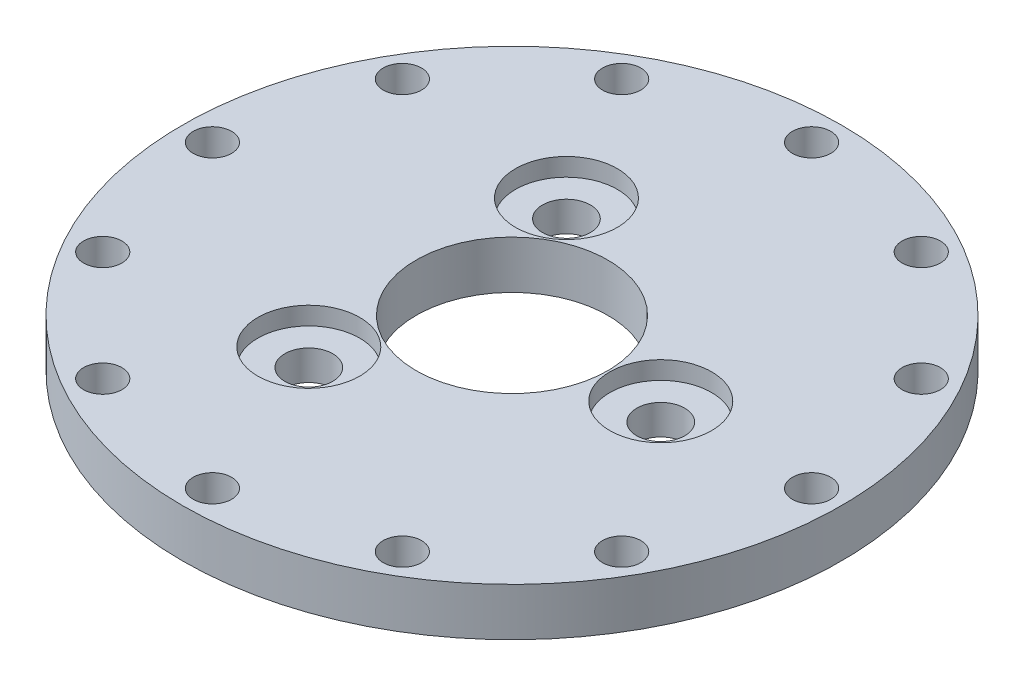
ISO-10303-21;
HEADER;
FILE_DESCRIPTION(('STEP AP214'),'2;1');
FILE_NAME('part.step','',(''),(''),'','','');
FILE_SCHEMA(('AUTOMOTIVE_DESIGN { 1 0 10303 214 1 1 1 1 }'));
ENDSEC;
DATA;
#1=APPLICATION_CONTEXT('core data for automotive mechanical design processes');
#2=APPLICATION_PROTOCOL_DEFINITION('international standard','automotive_design',2000,#1);
#3=PRODUCT_CONTEXT('',#1,'mechanical');
#4=PRODUCT('Part','Part','',(#3));
#5=PRODUCT_RELATED_PRODUCT_CATEGORY('part','',(#4));
#6=PRODUCT_DEFINITION_FORMATION('','',#4);
#7=PRODUCT_DEFINITION_CONTEXT('part definition',#1,'design');
#8=PRODUCT_DEFINITION('design','',#6,#7);
#9=PRODUCT_DEFINITION_SHAPE('','',#8);
#10=(LENGTH_UNIT() NAMED_UNIT(*) SI_UNIT(.MILLI.,.METRE.));
#11=(NAMED_UNIT(*) PLANE_ANGLE_UNIT() SI_UNIT($,.RADIAN.));
#12=(NAMED_UNIT(*) SI_UNIT($,.STERADIAN.) SOLID_ANGLE_UNIT());
#13=UNCERTAINTY_MEASURE_WITH_UNIT(LENGTH_MEASURE(1.E-05),#10,'distance_accuracy_value','');
#14=(GEOMETRIC_REPRESENTATION_CONTEXT(3) GLOBAL_UNCERTAINTY_ASSIGNED_CONTEXT((#13)) GLOBAL_UNIT_ASSIGNED_CONTEXT((#10,
#11,#12)) REPRESENTATION_CONTEXT('',''));
#15=CARTESIAN_POINT('',(0.,0.,0.));
#16=DIRECTION('',(0.,0.,1.));
#17=DIRECTION('',(1.,0.,0.));
#18=AXIS2_PLACEMENT_3D('',#15,#16,#17);
#19=CARTESIAN_POINT('',(12.413030787577,4.,0.));
#20=DIRECTION('',(0.,-1.,0.));
#21=DIRECTION('',(0.,0.,-1.));
#22=AXIS2_PLACEMENT_3D('',#19,#20,#21);
#23=CYLINDRICAL_SURFACE('',#22,2.);
#24=CARTESIAN_POINT('',(12.413030787577,0.,0.));
#25=DIRECTION('',(0.,1.,0.));
#26=DIRECTION('',(0.,0.,1.));
#27=AXIS2_PLACEMENT_3D('',#24,#25,#26);
#28=CIRCLE('',#27,2.);
#29=CARTESIAN_POINT('',(12.413030787577,0.,2.));
#30=VERTEX_POINT('',#29);
#31=EDGE_CURVE('E136',#30,#30,#28,.T.);
#32=ORIENTED_EDGE('',*,*,#31,.F.);
#33=EDGE_LOOP('',(#32));
#34=FACE_BOUND('',#33,.T.);
#35=CARTESIAN_POINT('',(12.413030787577,2.5,0.));
#36=DIRECTION('',(0.,1.,0.));
#37=DIRECTION('',(0.,0.,1.));
#38=AXIS2_PLACEMENT_3D('',#35,#36,#37);
#39=CIRCLE('',#38,2.);
#40=CARTESIAN_POINT('',(12.413030787577,2.5,2.));
#41=VERTEX_POINT('',#40);
#42=EDGE_CURVE('E35',#41,#41,#39,.T.);
#43=ORIENTED_EDGE('',*,*,#42,.T.);
#44=EDGE_LOOP('',(#43));
#45=FACE_BOUND('',#44,.T.);
#46=ADVANCED_FACE('F31',(#34,#45),#23,.F.);
#47=CARTESIAN_POINT('',(-6.20651539378818,4.,10.7500000000005));
#48=DIRECTION('',(0.,-1.,0.));
#49=DIRECTION('',(0.,0.,-1.));
#50=AXIS2_PLACEMENT_3D('',#47,#48,#49);
#51=CYLINDRICAL_SURFACE('',#50,1.99999999999955);
#52=CARTESIAN_POINT('',(-6.20651539378818,0.,10.7500000000005));
#53=DIRECTION('',(0.,1.,0.));
#54=DIRECTION('',(0.,0.,1.));
#55=AXIS2_PLACEMENT_3D('',#52,#53,#54);
#56=CIRCLE('',#55,1.99999999999955);
#57=CARTESIAN_POINT('',(-6.20651539378818,0.,12.7500000000001));
#58=VERTEX_POINT('',#57);
#59=EDGE_CURVE('E62',#58,#58,#56,.T.);
#60=ORIENTED_EDGE('',*,*,#59,.F.);
#61=EDGE_LOOP('',(#60));
#62=FACE_BOUND('',#61,.T.);
#63=CARTESIAN_POINT('',(-6.20651539378818,2.5,10.7500000000005));
#64=DIRECTION('',(0.,1.,0.));
#65=DIRECTION('',(0.,0.,1.));
#66=AXIS2_PLACEMENT_3D('',#63,#64,#65);
#67=CIRCLE('',#66,1.99999999999955);
#68=CARTESIAN_POINT('',(-6.20651539378818,2.5,12.7500000000001));
#69=VERTEX_POINT('',#68);
#70=EDGE_CURVE('E52',#69,#69,#67,.T.);
#71=ORIENTED_EDGE('',*,*,#70,.T.);
#72=EDGE_LOOP('',(#71));
#73=FACE_BOUND('',#72,.T.);
#74=ADVANCED_FACE('F169',(#62,#73),#51,.F.);
#75=CARTESIAN_POINT('',(-6.20651539378878,4.,-10.7499999999995));
#76=DIRECTION('',(0.,-1.,0.));
#77=DIRECTION('',(0.,0.,-1.));
#78=AXIS2_PLACEMENT_3D('',#75,#76,#77);
#79=CYLINDRICAL_SURFACE('',#78,2.00000000000009);
#80=CARTESIAN_POINT('',(-6.20651539378878,0.,-10.7499999999995));
#81=DIRECTION('',(0.,1.,0.));
#82=DIRECTION('',(0.,0.,1.));
#83=AXIS2_PLACEMENT_3D('',#80,#81,#82);
#84=CIRCLE('',#83,2.00000000000009);
#85=CARTESIAN_POINT('',(-6.20651539378878,0.,-8.74999999999939));
#86=VERTEX_POINT('',#85);
#87=EDGE_CURVE('E58',#86,#86,#84,.T.);
#88=ORIENTED_EDGE('',*,*,#87,.F.);
#89=EDGE_LOOP('',(#88));
#90=FACE_BOUND('',#89,.T.);
#91=CARTESIAN_POINT('',(-6.20651539378878,2.5,-10.7499999999995));
#92=DIRECTION('',(0.,1.,0.));
#93=DIRECTION('',(0.,0.,1.));
#94=AXIS2_PLACEMENT_3D('',#91,#92,#93);
#95=CIRCLE('',#94,2.00000000000009);
#96=CARTESIAN_POINT('',(-6.20651539378878,2.5,-8.74999999999939));
#97=VERTEX_POINT('',#96);
#98=EDGE_CURVE('E50',#97,#97,#95,.T.);
#99=ORIENTED_EDGE('',*,*,#98,.T.);
#100=EDGE_LOOP('',(#99));
#101=FACE_BOUND('',#100,.T.);
#102=ADVANCED_FACE('F175',(#90,#101),#79,.F.);
#103=CARTESIAN_POINT('',(0.,4.,0.));
#104=DIRECTION('',(0.,1.,0.));
#105=DIRECTION('',(0.,0.,1.));
#106=AXIS2_PLACEMENT_3D('',#103,#104,#105);
#107=PLANE('',#106);
#108=CARTESIAN_POINT('',(-6.20651539378878,4.,-10.7499999999995));
#109=DIRECTION('',(0.,1.,0.));
#110=DIRECTION('',(0.,0.,1.));
#111=AXIS2_PLACEMENT_3D('',#108,#109,#110);
#112=CIRCLE('',#111,4.25);
#113=CARTESIAN_POINT('',(-6.20651539378878,4.,-6.49999999999949));
#114=VERTEX_POINT('',#113);
#115=EDGE_CURVE('E256',#114,#114,#112,.T.);
#116=ORIENTED_EDGE('',*,*,#115,.F.);
#117=EDGE_LOOP('',(#116));
#118=FACE_BOUND('',#117,.T.);
#119=CARTESIAN_POINT('',(12.4130307875771,4.,-1.30958987979695E-12));
#120=DIRECTION('',(0.,1.,0.));
#121=DIRECTION('',(0.,0.,1.));
#122=AXIS2_PLACEMENT_3D('',#119,#120,#121);
#123=CIRCLE('',#122,4.25000000000093);
#124=CARTESIAN_POINT('',(12.4130307875771,4.,4.24999999999962));
#125=VERTEX_POINT('',#124);
#126=EDGE_CURVE('E264',#125,#125,#123,.T.);
#127=ORIENTED_EDGE('',*,*,#126,.F.);
#128=EDGE_LOOP('',(#127));
#129=FACE_BOUND('',#128,.T.);
#130=CARTESIAN_POINT('',(-6.20651539378696,4.,10.75));
#131=DIRECTION('',(0.,1.,0.));
#132=DIRECTION('',(0.,0.,1.));
#133=AXIS2_PLACEMENT_3D('',#130,#131,#132);
#134=CIRCLE('',#133,4.25000000000079);
#135=CARTESIAN_POINT('',(-6.20651539378696,4.,15.0000000000008));
#136=VERTEX_POINT('',#135);
#137=EDGE_CURVE('E70',#136,#136,#134,.T.);
#138=ORIENTED_EDGE('',*,*,#137,.F.);
#139=EDGE_LOOP('',(#138));
#140=FACE_BOUND('',#139,.T.);
#141=CARTESIAN_POINT('',(-21.6506350946106,4.,-12.4999999999994));
#142=DIRECTION('',(0.,1.,0.));
#143=DIRECTION('',(0.,0.,1.));
#144=AXIS2_PLACEMENT_3D('',#141,#142,#143);
#145=CIRCLE('',#144,1.6);
#146=CARTESIAN_POINT('',(-21.6506350946106,4.,-10.8999999999994));
#147=VERTEX_POINT('',#146);
#148=EDGE_CURVE('E79',#147,#147,#145,.T.);
#149=ORIENTED_EDGE('',*,*,#148,.F.);
#150=EDGE_LOOP('',(#149));
#151=FACE_BOUND('',#150,.T.);
#152=CARTESIAN_POINT('',(-21.6506350946099,4.,12.5000000000006));
#153=DIRECTION('',(0.,1.,0.));
#154=DIRECTION('',(0.,0.,1.));
#155=AXIS2_PLACEMENT_3D('',#152,#153,#154);
#156=CIRCLE('',#155,1.6);
#157=CARTESIAN_POINT('',(-21.6506350946099,4.,14.1000000000006));
#158=VERTEX_POINT('',#157);
#159=EDGE_CURVE('E91',#158,#158,#156,.T.);
#160=ORIENTED_EDGE('',*,*,#159,.F.);
#161=EDGE_LOOP('',(#160));
#162=FACE_BOUND('',#161,.T.);
#163=CARTESIAN_POINT('',(1.4119006205266E-12,4.,25.));
#164=DIRECTION('',(0.,1.,0.));
#165=DIRECTION('',(0.,0.,1.));
#166=AXIS2_PLACEMENT_3D('',#163,#164,#165);
#167=CIRCLE('',#166,1.6);
#168=CARTESIAN_POINT('',(1.4119006205266E-12,4.,26.6));
#169=VERTEX_POINT('',#168);
#170=EDGE_CURVE('E103',#169,#169,#167,.T.);
#171=ORIENTED_EDGE('',*,*,#170,.F.);
#172=EDGE_LOOP('',(#171));
#173=FACE_BOUND('',#172,.T.);
#174=CARTESIAN_POINT('',(21.650635094612,4.,12.4999999999994));
#175=DIRECTION('',(0.,1.,0.));
#176=DIRECTION('',(0.,0.,1.));
#177=AXIS2_PLACEMENT_3D('',#174,#175,#176);
#178=CIRCLE('',#177,1.6);
#179=CARTESIAN_POINT('',(21.650635094612,4.,14.0999999999994));
#180=VERTEX_POINT('',#179);
#181=EDGE_CURVE('E115',#180,#180,#178,.T.);
#182=ORIENTED_EDGE('',*,*,#181,.F.);
#183=EDGE_LOOP('',(#182));
#184=FACE_BOUND('',#183,.T.);
#185=CARTESIAN_POINT('',(21.6506350946113,4.,-12.5000000000006));
#186=DIRECTION('',(0.,1.,0.));
#187=DIRECTION('',(0.,0.,1.));
#188=AXIS2_PLACEMENT_3D('',#185,#186,#187);
#189=CIRCLE('',#188,1.6);
#190=CARTESIAN_POINT('',(21.6506350946113,4.,-10.9000000000006));
#191=VERTEX_POINT('',#190);
#192=EDGE_CURVE('E127',#191,#191,#189,.T.);
#193=ORIENTED_EDGE('',*,*,#192,.F.);
#194=EDGE_LOOP('',(#193));
#195=FACE_BOUND('',#194,.T.);
#196=CARTESIAN_POINT('',(0.,4.,-25.));
#197=DIRECTION('',(0.,1.,0.));
#198=DIRECTION('',(0.,0.,1.));
#199=AXIS2_PLACEMENT_3D('',#196,#197,#198);
#200=CIRCLE('',#199,1.6);
#201=CARTESIAN_POINT('',(0.,4.,-23.4));
#202=VERTEX_POINT('',#201);
#203=EDGE_CURVE('E44',#202,#202,#200,.T.);
#204=ORIENTED_EDGE('',*,*,#203,.F.);
#205=EDGE_LOOP('',(#204));
#206=FACE_BOUND('',#205,.T.);
#207=CARTESIAN_POINT('',(0.,4.,0.));
#208=DIRECTION('',(0.,1.,0.));
#209=DIRECTION('',(0.,0.,1.));
#210=AXIS2_PLACEMENT_3D('',#207,#208,#209);
#211=CIRCLE('',#210,27.5);
#212=CARTESIAN_POINT('',(0.,4.,27.5));
#213=VERTEX_POINT('',#212);
#214=EDGE_CURVE('E10',#213,#213,#211,.T.);
#215=ORIENTED_EDGE('',*,*,#214,.T.);
#216=EDGE_LOOP('',(#215));
#217=FACE_BOUND('',#216,.T.);
#218=CARTESIAN_POINT('',(0.,4.,0.));
#219=DIRECTION('',(0.,1.,0.));
#220=DIRECTION('',(0.,0.,1.));
#221=AXIS2_PLACEMENT_3D('',#218,#219,#220);
#222=CIRCLE('',#221,8.);
#223=CARTESIAN_POINT('',(0.,4.,8.));
#224=VERTEX_POINT('',#223);
#225=EDGE_CURVE('E142',#224,#224,#222,.T.);
#226=ORIENTED_EDGE('',*,*,#225,.F.);
#227=EDGE_LOOP('',(#226));
#228=FACE_BOUND('',#227,.T.);
#229=CARTESIAN_POINT('',(12.5,4.,-21.650635094611));
#230=DIRECTION('',(0.,1.,0.));
#231=DIRECTION('',(0.,0.,1.));
#232=AXIS2_PLACEMENT_3D('',#229,#230,#231);
#233=CIRCLE('',#232,1.6);
#234=CARTESIAN_POINT('',(12.5,4.,-20.0506350946109));
#235=VERTEX_POINT('',#234);
#236=EDGE_CURVE('E133',#235,#235,#233,.T.);
#237=ORIENTED_EDGE('',*,*,#236,.F.);
#238=EDGE_LOOP('',(#237));
#239=FACE_BOUND('',#238,.T.);
#240=CARTESIAN_POINT('',(25.0000000000007,4.,-7.05950310263298E-13));
#241=DIRECTION('',(0.,1.,0.));
#242=DIRECTION('',(0.,0.,1.));
#243=AXIS2_PLACEMENT_3D('',#240,#241,#242);
#244=CIRCLE('',#243,1.6);
#245=CARTESIAN_POINT('',(25.0000000000007,4.,1.5999999999993));
#246=VERTEX_POINT('',#245);
#247=EDGE_CURVE('E121',#246,#246,#244,.T.);
#248=ORIENTED_EDGE('',*,*,#247,.F.);
#249=EDGE_LOOP('',(#248));
#250=FACE_BOUND('',#249,.T.);
#251=CARTESIAN_POINT('',(12.5000000000013,4.,21.6506350946106));
#252=DIRECTION('',(0.,1.,0.));
#253=DIRECTION('',(0.,0.,1.));
#254=AXIS2_PLACEMENT_3D('',#251,#252,#253);
#255=CIRCLE('',#254,1.6);
#256=CARTESIAN_POINT('',(12.5000000000013,4.,23.2506350946106));
#257=VERTEX_POINT('',#256);
#258=EDGE_CURVE('E109',#257,#257,#255,.T.);
#259=ORIENTED_EDGE('',*,*,#258,.F.);
#260=EDGE_LOOP('',(#259));
#261=FACE_BOUND('',#260,.T.);
#262=CARTESIAN_POINT('',(-12.4999999999987,4.,21.6506350946113));
#263=DIRECTION('',(0.,1.,0.));
#264=DIRECTION('',(0.,0.,1.));
#265=AXIS2_PLACEMENT_3D('',#262,#263,#264);
#266=CIRCLE('',#265,1.6);
#267=CARTESIAN_POINT('',(-12.4999999999987,4.,23.2506350946113));
#268=VERTEX_POINT('',#267);
#269=EDGE_CURVE('E97',#268,#268,#266,.T.);
#270=ORIENTED_EDGE('',*,*,#269,.F.);
#271=EDGE_LOOP('',(#270));
#272=FACE_BOUND('',#271,.T.);
#273=CARTESIAN_POINT('',(-24.9999999999993,4.,7.09011927261166E-13));
#274=DIRECTION('',(0.,1.,0.));
#275=DIRECTION('',(0.,0.,1.));
#276=AXIS2_PLACEMENT_3D('',#273,#274,#275);
#277=CIRCLE('',#276,1.6);
#278=CARTESIAN_POINT('',(-24.9999999999993,4.,1.60000000000071));
#279=VERTEX_POINT('',#278);
#280=EDGE_CURVE('E85',#279,#279,#277,.T.);
#281=ORIENTED_EDGE('',*,*,#280,.F.);
#282=EDGE_LOOP('',(#281));
#283=FACE_BOUND('',#282,.T.);
#284=CARTESIAN_POINT('',(-12.4999999999997,4.,-21.6506350946111));
#285=DIRECTION('',(0.,1.,0.));
#286=DIRECTION('',(0.,0.,1.));
#287=AXIS2_PLACEMENT_3D('',#284,#285,#286);
#288=CIRCLE('',#287,1.6);
#289=CARTESIAN_POINT('',(-12.4999999999997,4.,-20.0506350946111));
#290=VERTEX_POINT('',#289);
#291=EDGE_CURVE('E73',#290,#290,#288,.T.);
#292=ORIENTED_EDGE('',*,*,#291,.F.);
#293=EDGE_LOOP('',(#292));
#294=FACE_BOUND('',#293,.T.);
#295=ADVANCED_FACE('F226',(#118,#129,#140,#151,#162,#173,#184,#195,#206,#217,#228,#239,#250,
#261,#272,#283,#294),#107,.T.);
#296=CARTESIAN_POINT('',(0.,0.,0.));
#297=DIRECTION('',(0.,1.,0.));
#298=DIRECTION('',(0.,0.,1.));
#299=AXIS2_PLACEMENT_3D('',#296,#297,#298);
#300=PLANE('',#299);
#301=CARTESIAN_POINT('',(0.,0.,0.));
#302=DIRECTION('',(0.,1.,0.));
#303=DIRECTION('',(0.,0.,1.));
#304=AXIS2_PLACEMENT_3D('',#301,#302,#303);
#305=CIRCLE('',#304,27.5);
#306=CARTESIAN_POINT('',(0.,0.,27.5));
#307=VERTEX_POINT('',#306);
#308=EDGE_CURVE('E39',#307,#307,#305,.T.);
#309=ORIENTED_EDGE('',*,*,#308,.F.);
#310=EDGE_LOOP('',(#309));
#311=FACE_BOUND('',#310,.T.);
#312=CARTESIAN_POINT('',(0.,0.,-25.));
#313=DIRECTION('',(0.,1.,0.));
#314=DIRECTION('',(0.,0.,1.));
#315=AXIS2_PLACEMENT_3D('',#312,#313,#314);
#316=CIRCLE('',#315,1.6);
#317=CARTESIAN_POINT('',(0.,0.,-23.4));
#318=VERTEX_POINT('',#317);
#319=EDGE_CURVE('E47',#318,#318,#316,.T.);
#320=ORIENTED_EDGE('',*,*,#319,.T.);
#321=EDGE_LOOP('',(#320));
#322=FACE_BOUND('',#321,.T.);
#323=CARTESIAN_POINT('',(0.,0.,0.));
#324=DIRECTION('',(0.,1.,0.));
#325=DIRECTION('',(0.,0.,1.));
#326=AXIS2_PLACEMENT_3D('',#323,#324,#325);
#327=CIRCLE('',#326,8.);
#328=CARTESIAN_POINT('',(0.,0.,8.));
#329=VERTEX_POINT('',#328);
#330=EDGE_CURVE('E141',#329,#329,#327,.T.);
#331=ORIENTED_EDGE('',*,*,#330,.T.);
#332=EDGE_LOOP('',(#331));
#333=FACE_BOUND('',#332,.T.);
#334=ORIENTED_EDGE('',*,*,#31,.T.);
#335=EDGE_LOOP('',(#334));
#336=FACE_BOUND('',#335,.T.);
#337=CARTESIAN_POINT('',(12.5,0.,-21.650635094611));
#338=DIRECTION('',(0.,1.,0.));
#339=DIRECTION('',(0.,0.,1.));
#340=AXIS2_PLACEMENT_3D('',#337,#338,#339);
#341=CIRCLE('',#340,1.6);
#342=CARTESIAN_POINT('',(12.5,0.,-20.0506350946109));
#343=VERTEX_POINT('',#342);
#344=EDGE_CURVE('E130',#343,#343,#341,.T.);
#345=ORIENTED_EDGE('',*,*,#344,.T.);
#346=EDGE_LOOP('',(#345));
#347=FACE_BOUND('',#346,.T.);
#348=CARTESIAN_POINT('',(21.6506350946113,0.,-12.5000000000006));
#349=DIRECTION('',(0.,1.,0.));
#350=DIRECTION('',(0.,0.,1.));
#351=AXIS2_PLACEMENT_3D('',#348,#349,#350);
#352=CIRCLE('',#351,1.6);
#353=CARTESIAN_POINT('',(21.6506350946113,0.,-10.9000000000006));
#354=VERTEX_POINT('',#353);
#355=EDGE_CURVE('E124',#354,#354,#352,.T.);
#356=ORIENTED_EDGE('',*,*,#355,.T.);
#357=EDGE_LOOP('',(#356));
#358=FACE_BOUND('',#357,.T.);
#359=CARTESIAN_POINT('',(25.0000000000007,0.,-7.05950310263298E-13));
#360=DIRECTION('',(0.,1.,0.));
#361=DIRECTION('',(0.,0.,1.));
#362=AXIS2_PLACEMENT_3D('',#359,#360,#361);
#363=CIRCLE('',#362,1.6);
#364=CARTESIAN_POINT('',(25.0000000000007,0.,1.5999999999993));
#365=VERTEX_POINT('',#364);
#366=EDGE_CURVE('E118',#365,#365,#363,.T.);
#367=ORIENTED_EDGE('',*,*,#366,.T.);
#368=EDGE_LOOP('',(#367));
#369=FACE_BOUND('',#368,.T.);
#370=CARTESIAN_POINT('',(21.650635094612,0.,12.4999999999994));
#371=DIRECTION('',(0.,1.,0.));
#372=DIRECTION('',(0.,0.,1.));
#373=AXIS2_PLACEMENT_3D('',#370,#371,#372);
#374=CIRCLE('',#373,1.6);
#375=CARTESIAN_POINT('',(21.650635094612,0.,14.0999999999994));
#376=VERTEX_POINT('',#375);
#377=EDGE_CURVE('E112',#376,#376,#374,.T.);
#378=ORIENTED_EDGE('',*,*,#377,.T.);
#379=EDGE_LOOP('',(#378));
#380=FACE_BOUND('',#379,.T.);
#381=CARTESIAN_POINT('',(12.5000000000013,0.,21.6506350946106));
#382=DIRECTION('',(0.,1.,0.));
#383=DIRECTION('',(0.,0.,1.));
#384=AXIS2_PLACEMENT_3D('',#381,#382,#383);
#385=CIRCLE('',#384,1.6);
#386=CARTESIAN_POINT('',(12.5000000000013,0.,23.2506350946106));
#387=VERTEX_POINT('',#386);
#388=EDGE_CURVE('E106',#387,#387,#385,.T.);
#389=ORIENTED_EDGE('',*,*,#388,.T.);
#390=EDGE_LOOP('',(#389));
#391=FACE_BOUND('',#390,.T.);
#392=CARTESIAN_POINT('',(1.4119006205266E-12,0.,25.));
#393=DIRECTION('',(0.,1.,0.));
#394=DIRECTION('',(0.,0.,1.));
#395=AXIS2_PLACEMENT_3D('',#392,#393,#394);
#396=CIRCLE('',#395,1.6);
#397=CARTESIAN_POINT('',(1.4119006205266E-12,0.,26.6));
#398=VERTEX_POINT('',#397);
#399=EDGE_CURVE('E100',#398,#398,#396,.T.);
#400=ORIENTED_EDGE('',*,*,#399,.T.);
#401=EDGE_LOOP('',(#400));
#402=FACE_BOUND('',#401,.T.);
#403=CARTESIAN_POINT('',(-12.4999999999987,0.,21.6506350946113));
#404=DIRECTION('',(0.,1.,0.));
#405=DIRECTION('',(0.,0.,1.));
#406=AXIS2_PLACEMENT_3D('',#403,#404,#405);
#407=CIRCLE('',#406,1.6);
#408=CARTESIAN_POINT('',(-12.4999999999987,0.,23.2506350946113));
#409=VERTEX_POINT('',#408);
#410=EDGE_CURVE('E94',#409,#409,#407,.T.);
#411=ORIENTED_EDGE('',*,*,#410,.T.);
#412=EDGE_LOOP('',(#411));
#413=FACE_BOUND('',#412,.T.);
#414=CARTESIAN_POINT('',(-21.6506350946099,0.,12.5000000000006));
#415=DIRECTION('',(0.,1.,0.));
#416=DIRECTION('',(0.,0.,1.));
#417=AXIS2_PLACEMENT_3D('',#414,#415,#416);
#418=CIRCLE('',#417,1.6);
#419=CARTESIAN_POINT('',(-21.6506350946099,0.,14.1000000000006));
#420=VERTEX_POINT('',#419);
#421=EDGE_CURVE('E88',#420,#420,#418,.T.);
#422=ORIENTED_EDGE('',*,*,#421,.T.);
#423=EDGE_LOOP('',(#422));
#424=FACE_BOUND('',#423,.T.);
#425=CARTESIAN_POINT('',(-24.9999999999993,0.,7.09011927261166E-13));
#426=DIRECTION('',(0.,1.,0.));
#427=DIRECTION('',(0.,0.,1.));
#428=AXIS2_PLACEMENT_3D('',#425,#426,#427);
#429=CIRCLE('',#428,1.6);
#430=CARTESIAN_POINT('',(-24.9999999999993,0.,1.60000000000071));
#431=VERTEX_POINT('',#430);
#432=EDGE_CURVE('E82',#431,#431,#429,.T.);
#433=ORIENTED_EDGE('',*,*,#432,.T.);
#434=EDGE_LOOP('',(#433));
#435=FACE_BOUND('',#434,.T.);
#436=CARTESIAN_POINT('',(-21.6506350946106,0.,-12.4999999999994));
#437=DIRECTION('',(0.,1.,0.));
#438=DIRECTION('',(0.,0.,1.));
#439=AXIS2_PLACEMENT_3D('',#436,#437,#438);
#440=CIRCLE('',#439,1.6);
#441=CARTESIAN_POINT('',(-21.6506350946106,0.,-10.8999999999994));
#442=VERTEX_POINT('',#441);
#443=EDGE_CURVE('E76',#442,#442,#440,.T.);
#444=ORIENTED_EDGE('',*,*,#443,.T.);
#445=EDGE_LOOP('',(#444));
#446=FACE_BOUND('',#445,.T.);
#447=CARTESIAN_POINT('',(-12.4999999999997,0.,-21.6506350946111));
#448=DIRECTION('',(0.,1.,0.));
#449=DIRECTION('',(0.,0.,1.));
#450=AXIS2_PLACEMENT_3D('',#447,#448,#449);
#451=CIRCLE('',#450,1.6);
#452=CARTESIAN_POINT('',(-12.4999999999997,0.,-20.0506350946111));
#453=VERTEX_POINT('',#452);
#454=EDGE_CURVE('E67',#453,#453,#451,.T.);
#455=ORIENTED_EDGE('',*,*,#454,.T.);
#456=EDGE_LOOP('',(#455));
#457=FACE_BOUND('',#456,.T.);
#458=ORIENTED_EDGE('',*,*,#59,.T.);
#459=EDGE_LOOP('',(#458));
#460=FACE_BOUND('',#459,.T.);
#461=ORIENTED_EDGE('',*,*,#87,.T.);
#462=EDGE_LOOP('',(#461));
#463=FACE_BOUND('',#462,.T.);
#464=ADVANCED_FACE('F152',(#311,#322,#333,#336,#347,#358,#369,#380,#391,#402,#413,#424,#435,
#446,#457,#460,#463),#300,.F.);
#465=CARTESIAN_POINT('',(0.,4.,0.));
#466=DIRECTION('',(0.,-1.,0.));
#467=DIRECTION('',(0.,0.,-1.));
#468=AXIS2_PLACEMENT_3D('',#465,#466,#467);
#469=CYLINDRICAL_SURFACE('',#468,27.5);
#470=ORIENTED_EDGE('',*,*,#214,.F.);
#471=EDGE_LOOP('',(#470));
#472=FACE_BOUND('',#471,.T.);
#473=ORIENTED_EDGE('',*,*,#308,.T.);
#474=EDGE_LOOP('',(#473));
#475=FACE_BOUND('',#474,.T.);
#476=ADVANCED_FACE('F33',(#472,#475),#469,.T.);
#477=CARTESIAN_POINT('',(0.,4.,-25.));
#478=DIRECTION('',(0.,-1.,0.));
#479=DIRECTION('',(0.,0.,-1.));
#480=AXIS2_PLACEMENT_3D('',#477,#478,#479);
#481=CYLINDRICAL_SURFACE('',#480,1.6);
#482=ORIENTED_EDGE('',*,*,#203,.T.);
#483=EDGE_LOOP('',(#482));
#484=FACE_BOUND('',#483,.T.);
#485=ORIENTED_EDGE('',*,*,#319,.F.);
#486=EDGE_LOOP('',(#485));
#487=FACE_BOUND('',#486,.T.);
#488=ADVANCED_FACE('F155',(#484,#487),#481,.F.);
#489=CARTESIAN_POINT('',(0.,4.,0.));
#490=DIRECTION('',(0.,-1.,0.));
#491=DIRECTION('',(0.,0.,-1.));
#492=AXIS2_PLACEMENT_3D('',#489,#490,#491);
#493=CYLINDRICAL_SURFACE('',#492,8.);
#494=ORIENTED_EDGE('',*,*,#225,.T.);
#495=EDGE_LOOP('',(#494));
#496=FACE_BOUND('',#495,.T.);
#497=ORIENTED_EDGE('',*,*,#330,.F.);
#498=EDGE_LOOP('',(#497));
#499=FACE_BOUND('',#498,.T.);
#500=ADVANCED_FACE('F157',(#496,#499),#493,.F.);
#501=CARTESIAN_POINT('',(12.5,4.,-21.650635094611));
#502=DIRECTION('',(0.,-1.,0.));
#503=DIRECTION('',(0.,0.,-1.));
#504=AXIS2_PLACEMENT_3D('',#501,#502,#503);
#505=CYLINDRICAL_SURFACE('',#504,1.6);
#506=ORIENTED_EDGE('',*,*,#236,.T.);
#507=EDGE_LOOP('',(#506));
#508=FACE_BOUND('',#507,.T.);
#509=ORIENTED_EDGE('',*,*,#344,.F.);
#510=EDGE_LOOP('',(#509));
#511=FACE_BOUND('',#510,.T.);
#512=ADVANCED_FACE('F163',(#508,#511),#505,.F.);
#513=CARTESIAN_POINT('',(21.6506350946113,4.,-12.5000000000006));
#514=DIRECTION('',(0.,-1.,0.));
#515=DIRECTION('',(0.,0.,-1.));
#516=AXIS2_PLACEMENT_3D('',#513,#514,#515);
#517=CYLINDRICAL_SURFACE('',#516,1.6);
#518=ORIENTED_EDGE('',*,*,#192,.T.);
#519=EDGE_LOOP('',(#518));
#520=FACE_BOUND('',#519,.T.);
#521=ORIENTED_EDGE('',*,*,#355,.F.);
#522=EDGE_LOOP('',(#521));
#523=FACE_BOUND('',#522,.T.);
#524=ADVANCED_FACE('F182',(#520,#523),#517,.F.);
#525=CARTESIAN_POINT('',(25.0000000000007,4.,-7.05950310263298E-13));
#526=DIRECTION('',(0.,-1.,0.));
#527=DIRECTION('',(0.,0.,-1.));
#528=AXIS2_PLACEMENT_3D('',#525,#526,#527);
#529=CYLINDRICAL_SURFACE('',#528,1.6);
#530=ORIENTED_EDGE('',*,*,#247,.T.);
#531=EDGE_LOOP('',(#530));
#532=FACE_BOUND('',#531,.T.);
#533=ORIENTED_EDGE('',*,*,#366,.F.);
#534=EDGE_LOOP('',(#533));
#535=FACE_BOUND('',#534,.T.);
#536=ADVANCED_FACE('F186',(#532,#535),#529,.F.);
#537=CARTESIAN_POINT('',(21.650635094612,4.,12.4999999999994));
#538=DIRECTION('',(0.,-1.,0.));
#539=DIRECTION('',(0.,0.,-1.));
#540=AXIS2_PLACEMENT_3D('',#537,#538,#539);
#541=CYLINDRICAL_SURFACE('',#540,1.6);
#542=ORIENTED_EDGE('',*,*,#181,.T.);
#543=EDGE_LOOP('',(#542));
#544=FACE_BOUND('',#543,.T.);
#545=ORIENTED_EDGE('',*,*,#377,.F.);
#546=EDGE_LOOP('',(#545));
#547=FACE_BOUND('',#546,.T.);
#548=ADVANCED_FACE('F190',(#544,#547),#541,.F.);
#549=CARTESIAN_POINT('',(12.5000000000013,4.,21.6506350946106));
#550=DIRECTION('',(0.,-1.,0.));
#551=DIRECTION('',(0.,0.,-1.));
#552=AXIS2_PLACEMENT_3D('',#549,#550,#551);
#553=CYLINDRICAL_SURFACE('',#552,1.6);
#554=ORIENTED_EDGE('',*,*,#258,.T.);
#555=EDGE_LOOP('',(#554));
#556=FACE_BOUND('',#555,.T.);
#557=ORIENTED_EDGE('',*,*,#388,.F.);
#558=EDGE_LOOP('',(#557));
#559=FACE_BOUND('',#558,.T.);
#560=ADVANCED_FACE('F194',(#556,#559),#553,.F.);
#561=CARTESIAN_POINT('',(1.4119006205266E-12,4.,25.));
#562=DIRECTION('',(0.,-1.,0.));
#563=DIRECTION('',(0.,0.,-1.));
#564=AXIS2_PLACEMENT_3D('',#561,#562,#563);
#565=CYLINDRICAL_SURFACE('',#564,1.6);
#566=ORIENTED_EDGE('',*,*,#170,.T.);
#567=EDGE_LOOP('',(#566));
#568=FACE_BOUND('',#567,.T.);
#569=ORIENTED_EDGE('',*,*,#399,.F.);
#570=EDGE_LOOP('',(#569));
#571=FACE_BOUND('',#570,.T.);
#572=ADVANCED_FACE('F198',(#568,#571),#565,.F.);
#573=CARTESIAN_POINT('',(-12.4999999999987,4.,21.6506350946113));
#574=DIRECTION('',(0.,-1.,0.));
#575=DIRECTION('',(0.,0.,-1.));
#576=AXIS2_PLACEMENT_3D('',#573,#574,#575);
#577=CYLINDRICAL_SURFACE('',#576,1.6);
#578=ORIENTED_EDGE('',*,*,#269,.T.);
#579=EDGE_LOOP('',(#578));
#580=FACE_BOUND('',#579,.T.);
#581=ORIENTED_EDGE('',*,*,#410,.F.);
#582=EDGE_LOOP('',(#581));
#583=FACE_BOUND('',#582,.T.);
#584=ADVANCED_FACE('F202',(#580,#583),#577,.F.);
#585=CARTESIAN_POINT('',(-21.6506350946099,4.,12.5000000000006));
#586=DIRECTION('',(0.,-1.,0.));
#587=DIRECTION('',(0.,0.,-1.));
#588=AXIS2_PLACEMENT_3D('',#585,#586,#587);
#589=CYLINDRICAL_SURFACE('',#588,1.6);
#590=ORIENTED_EDGE('',*,*,#159,.T.);
#591=EDGE_LOOP('',(#590));
#592=FACE_BOUND('',#591,.T.);
#593=ORIENTED_EDGE('',*,*,#421,.F.);
#594=EDGE_LOOP('',(#593));
#595=FACE_BOUND('',#594,.T.);
#596=ADVANCED_FACE('F206',(#592,#595),#589,.F.);
#597=CARTESIAN_POINT('',(-24.9999999999993,4.,7.09011927261166E-13));
#598=DIRECTION('',(0.,-1.,0.));
#599=DIRECTION('',(0.,0.,-1.));
#600=AXIS2_PLACEMENT_3D('',#597,#598,#599);
#601=CYLINDRICAL_SURFACE('',#600,1.6);
#602=ORIENTED_EDGE('',*,*,#280,.T.);
#603=EDGE_LOOP('',(#602));
#604=FACE_BOUND('',#603,.T.);
#605=ORIENTED_EDGE('',*,*,#432,.F.);
#606=EDGE_LOOP('',(#605));
#607=FACE_BOUND('',#606,.T.);
#608=ADVANCED_FACE('F210',(#604,#607),#601,.F.);
#609=CARTESIAN_POINT('',(-21.6506350946106,4.,-12.4999999999994));
#610=DIRECTION('',(0.,-1.,0.));
#611=DIRECTION('',(0.,0.,-1.));
#612=AXIS2_PLACEMENT_3D('',#609,#610,#611);
#613=CYLINDRICAL_SURFACE('',#612,1.6);
#614=ORIENTED_EDGE('',*,*,#148,.T.);
#615=EDGE_LOOP('',(#614));
#616=FACE_BOUND('',#615,.T.);
#617=ORIENTED_EDGE('',*,*,#443,.F.);
#618=EDGE_LOOP('',(#617));
#619=FACE_BOUND('',#618,.T.);
#620=ADVANCED_FACE('F214',(#616,#619),#613,.F.);
#621=CARTESIAN_POINT('',(-12.4999999999997,4.,-21.6506350946111));
#622=DIRECTION('',(0.,-1.,0.));
#623=DIRECTION('',(0.,0.,-1.));
#624=AXIS2_PLACEMENT_3D('',#621,#622,#623);
#625=CYLINDRICAL_SURFACE('',#624,1.6);
#626=ORIENTED_EDGE('',*,*,#291,.T.);
#627=EDGE_LOOP('',(#626));
#628=FACE_BOUND('',#627,.T.);
#629=ORIENTED_EDGE('',*,*,#454,.F.);
#630=EDGE_LOOP('',(#629));
#631=FACE_BOUND('',#630,.T.);
#632=ADVANCED_FACE('F218',(#628,#631),#625,.F.);
#633=CARTESIAN_POINT('',(-6.20651539378878,2.5,-10.7499999999995));
#634=DIRECTION('',(0.,1.,0.));
#635=DIRECTION('',(0.,0.,1.));
#636=AXIS2_PLACEMENT_3D('',#633,#634,#635);
#637=CYLINDRICAL_SURFACE('',#636,4.25);
#638=CARTESIAN_POINT('',(-6.20651539378878,2.5,-10.7499999999995));
#639=DIRECTION('',(0.,1.,0.));
#640=DIRECTION('',(0.,0.,1.));
#641=AXIS2_PLACEMENT_3D('',#638,#639,#640);
#642=CIRCLE('',#641,4.25);
#643=CARTESIAN_POINT('',(-6.20651539378878,2.5,-6.49999999999949));
#644=VERTEX_POINT('',#643);
#645=EDGE_CURVE('E53',#644,#644,#642,.T.);
#646=ORIENTED_EDGE('',*,*,#645,.F.);
#647=EDGE_LOOP('',(#646));
#648=FACE_BOUND('',#647,.T.);
#649=ORIENTED_EDGE('',*,*,#115,.T.);
#650=EDGE_LOOP('',(#649));
#651=FACE_BOUND('',#650,.T.);
#652=ADVANCED_FACE('F221',(#648,#651),#637,.F.);
#653=CARTESIAN_POINT('',(-6.20651539378878,2.5,-10.7499999999995));
#654=DIRECTION('',(0.,1.,0.));
#655=DIRECTION('',(0.,0.,1.));
#656=AXIS2_PLACEMENT_3D('',#653,#654,#655);
#657=PLANE('',#656);
#658=ORIENTED_EDGE('',*,*,#98,.F.);
#659=EDGE_LOOP('',(#658));
#660=FACE_BOUND('',#659,.T.);
#661=ORIENTED_EDGE('',*,*,#645,.T.);
#662=EDGE_LOOP('',(#661));
#663=FACE_BOUND('',#662,.T.);
#664=ADVANCED_FACE('F232',(#660,#663),#657,.T.);
#665=CARTESIAN_POINT('',(-6.20651539378696,2.5,10.75));
#666=DIRECTION('',(0.,1.,0.));
#667=DIRECTION('',(0.,0.,1.));
#668=AXIS2_PLACEMENT_3D('',#665,#666,#667);
#669=CYLINDRICAL_SURFACE('',#668,4.25000000000079);
#670=CARTESIAN_POINT('',(-6.20651539378696,2.5,10.75));
#671=DIRECTION('',(0.,1.,0.));
#672=DIRECTION('',(0.,0.,1.));
#673=AXIS2_PLACEMENT_3D('',#670,#671,#672);
#674=CIRCLE('',#673,4.25000000000079);
#675=CARTESIAN_POINT('',(-6.20651539378696,2.5,15.0000000000008));
#676=VERTEX_POINT('',#675);
#677=EDGE_CURVE('E266',#676,#676,#674,.T.);
#678=ORIENTED_EDGE('',*,*,#677,.F.);
#679=EDGE_LOOP('',(#678));
#680=FACE_BOUND('',#679,.T.);
#681=ORIENTED_EDGE('',*,*,#137,.T.);
#682=EDGE_LOOP('',(#681));
#683=FACE_BOUND('',#682,.T.);
#684=ADVANCED_FACE('F228',(#680,#683),#669,.F.);
#685=CARTESIAN_POINT('',(-6.20651539378696,2.5,10.75));
#686=DIRECTION('',(0.,1.,0.));
#687=DIRECTION('',(0.,0.,1.));
#688=AXIS2_PLACEMENT_3D('',#685,#686,#687);
#689=PLANE('',#688);
#690=ORIENTED_EDGE('',*,*,#70,.F.);
#691=EDGE_LOOP('',(#690));
#692=FACE_BOUND('',#691,.T.);
#693=ORIENTED_EDGE('',*,*,#677,.T.);
#694=EDGE_LOOP('',(#693));
#695=FACE_BOUND('',#694,.T.);
#696=ADVANCED_FACE('F231',(#692,#695),#689,.T.);
#697=CARTESIAN_POINT('',(12.4130307875771,2.5,-1.30958987979695E-12));
#698=DIRECTION('',(0.,1.,0.));
#699=DIRECTION('',(0.,0.,1.));
#700=AXIS2_PLACEMENT_3D('',#697,#698,#699);
#701=CYLINDRICAL_SURFACE('',#700,4.25000000000093);
#702=CARTESIAN_POINT('',(12.4130307875771,2.5,-1.30958987979695E-12));
#703=DIRECTION('',(0.,1.,0.));
#704=DIRECTION('',(0.,0.,1.));
#705=AXIS2_PLACEMENT_3D('',#702,#703,#704);
#706=CIRCLE('',#705,4.25000000000093);
#707=CARTESIAN_POINT('',(12.4130307875771,2.5,4.24999999999962));
#708=VERTEX_POINT('',#707);
#709=EDGE_CURVE('E259',#708,#708,#706,.T.);
#710=ORIENTED_EDGE('',*,*,#709,.F.);
#711=EDGE_LOOP('',(#710));
#712=FACE_BOUND('',#711,.T.);
#713=ORIENTED_EDGE('',*,*,#126,.T.);
#714=EDGE_LOOP('',(#713));
#715=FACE_BOUND('',#714,.T.);
#716=ADVANCED_FACE('F236',(#712,#715),#701,.F.);
#717=CARTESIAN_POINT('',(12.4130307875771,2.5,-1.30958987979695E-12));
#718=DIRECTION('',(0.,1.,0.));
#719=DIRECTION('',(0.,0.,1.));
#720=AXIS2_PLACEMENT_3D('',#717,#718,#719);
#721=PLANE('',#720);
#722=ORIENTED_EDGE('',*,*,#42,.F.);
#723=EDGE_LOOP('',(#722));
#724=FACE_BOUND('',#723,.T.);
#725=ORIENTED_EDGE('',*,*,#709,.T.);
#726=EDGE_LOOP('',(#725));
#727=FACE_BOUND('',#726,.T.);
#728=ADVANCED_FACE('F240',(#724,#727),#721,.T.);
#729=CLOSED_SHELL('',(#46,#74,#102,#295,#464,#476,#488,#500,#512,#524,#536,#548,#560,#572,#584,
#596,#608,#620,#632,#652,#664,#684,#696,#716,#728));
#730=MANIFOLD_SOLID_BREP('B2',#729);
#731=ADVANCED_BREP_SHAPE_REPRESENTATION('',(#18,#730),#14);
#732=SHAPE_DEFINITION_REPRESENTATION(#9,#731);
ENDSEC;
END-ISO-10303-21;
